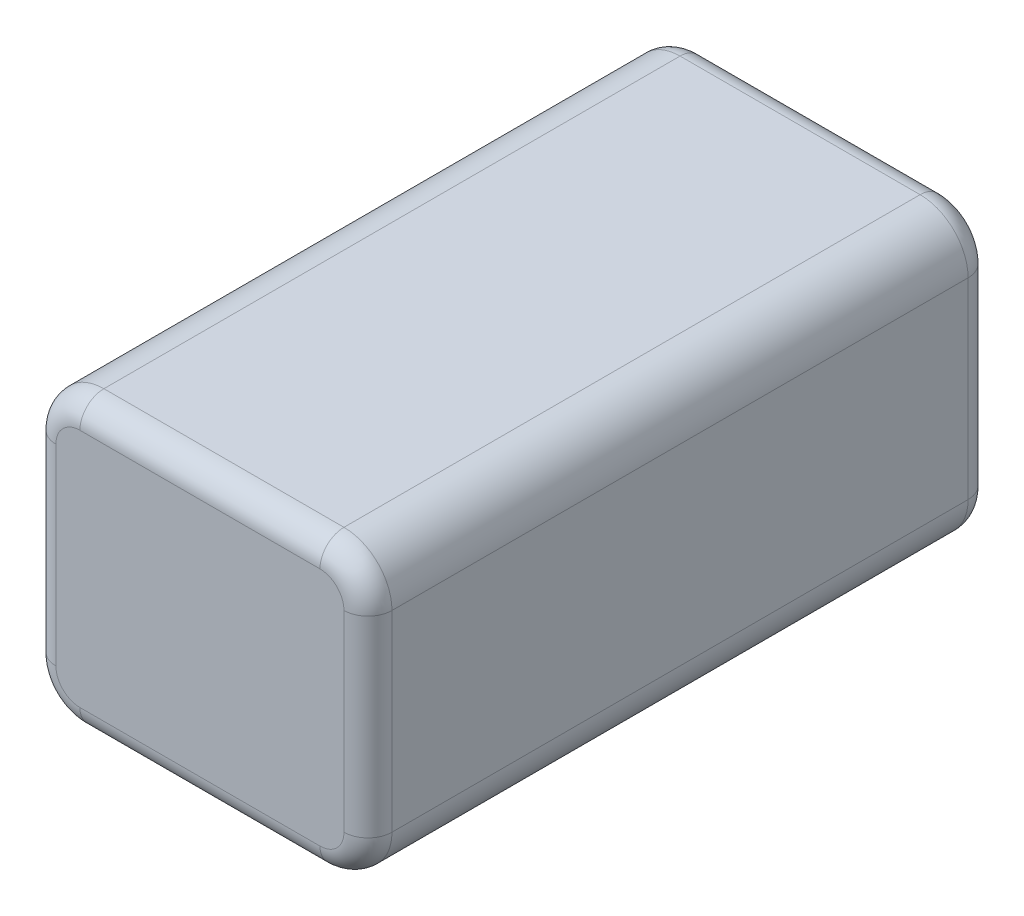
ISO-10303-21;
HEADER;
FILE_DESCRIPTION(('STEP AP214'),'2;1');
FILE_NAME('part.step','',(''),(''),'','','');
FILE_SCHEMA(('AUTOMOTIVE_DESIGN { 1 0 10303 214 1 1 1 1 }'));
ENDSEC;
DATA;
#1=APPLICATION_CONTEXT('core data for automotive mechanical design processes');
#2=APPLICATION_PROTOCOL_DEFINITION('international standard','automotive_design',2000,#1);
#3=PRODUCT_CONTEXT('',#1,'mechanical');
#4=PRODUCT('Part','Part','',(#3));
#5=PRODUCT_RELATED_PRODUCT_CATEGORY('part','',(#4));
#6=PRODUCT_DEFINITION_FORMATION('','',#4);
#7=PRODUCT_DEFINITION_CONTEXT('part definition',#1,'design');
#8=PRODUCT_DEFINITION('design','',#6,#7);
#9=PRODUCT_DEFINITION_SHAPE('','',#8);
#10=(LENGTH_UNIT() NAMED_UNIT(*) SI_UNIT(.MILLI.,.METRE.));
#11=(NAMED_UNIT(*) PLANE_ANGLE_UNIT() SI_UNIT($,.RADIAN.));
#12=(NAMED_UNIT(*) SI_UNIT($,.STERADIAN.) SOLID_ANGLE_UNIT());
#13=UNCERTAINTY_MEASURE_WITH_UNIT(LENGTH_MEASURE(1.E-05),#10,'distance_accuracy_value','');
#14=(GEOMETRIC_REPRESENTATION_CONTEXT(3) GLOBAL_UNCERTAINTY_ASSIGNED_CONTEXT((#13)) GLOBAL_UNIT_ASSIGNED_CONTEXT((#10,
#11,#12)) REPRESENTATION_CONTEXT('',''));
#15=CARTESIAN_POINT('',(0.,0.,0.));
#16=DIRECTION('',(0.,0.,1.));
#17=DIRECTION('',(1.,0.,0.));
#18=AXIS2_PLACEMENT_3D('',#15,#16,#17);
#19=CARTESIAN_POINT('',(12.7,10.16,33.02));
#20=DIRECTION('',(0.,0.,-1.));
#21=DIRECTION('',(-1.,0.,0.));
#22=AXIS2_PLACEMENT_3D('',#19,#20,#21);
#23=CYLINDRICAL_SURFACE('',#22,5.08);
#24=DIRECTION('',(0.,0.,-1.));
#25=VECTOR('',#24,1.);
#26=CARTESIAN_POINT('',(17.78,10.16,33.02));
#27=LINE('',#26,#25);
#28=CARTESIAN_POINT('',(17.78,10.16,30.48));
#29=VERTEX_POINT('',#28);
#30=CARTESIAN_POINT('',(17.78,10.16,-30.48));
#31=VERTEX_POINT('',#30);
#32=EDGE_CURVE('E263',#29,#31,#27,.T.);
#33=ORIENTED_EDGE('',*,*,#32,.T.);
#34=CARTESIAN_POINT('',(12.7,10.16,-30.48));
#35=DIRECTION('',(0.,0.,-1.));
#36=DIRECTION('',(-1.,0.,0.));
#37=AXIS2_PLACEMENT_3D('',#34,#35,#36);
#38=CIRCLE('',#37,5.08);
#39=CARTESIAN_POINT('',(12.7,15.24,-30.48));
#40=VERTEX_POINT('',#39);
#41=EDGE_CURVE('E228',#31,#40,#38,.F.);
#42=ORIENTED_EDGE('',*,*,#41,.T.);
#43=DIRECTION('',(0.,0.,-1.));
#44=VECTOR('',#43,1.);
#45=CARTESIAN_POINT('',(12.7,15.24,33.02));
#46=LINE('',#45,#44);
#47=CARTESIAN_POINT('',(12.7,15.24,30.48));
#48=VERTEX_POINT('',#47);
#49=EDGE_CURVE('E167',#48,#40,#46,.T.);
#50=ORIENTED_EDGE('',*,*,#49,.F.);
#51=CARTESIAN_POINT('',(12.7,10.16,30.48));
#52=DIRECTION('',(0.,0.,-1.));
#53=DIRECTION('',(-1.,0.,0.));
#54=AXIS2_PLACEMENT_3D('',#51,#52,#53);
#55=CIRCLE('',#54,5.08);
#56=EDGE_CURVE('E226',#48,#29,#55,.T.);
#57=ORIENTED_EDGE('',*,*,#56,.T.);
#58=EDGE_LOOP('',(#33,#42,#50,#57));
#59=FACE_BOUND('',#58,.T.);
#60=ADVANCED_FACE('F31',(#59),#23,.T.);
#61=CARTESIAN_POINT('',(-12.7,15.24,33.02));
#62=DIRECTION('',(0.,-1.,0.));
#63=DIRECTION('',(0.,0.,-1.));
#64=AXIS2_PLACEMENT_3D('',#61,#62,#63);
#65=PLANE('',#64);
#66=ORIENTED_EDGE('',*,*,#49,.T.);
#67=DIRECTION('',(-1.,0.,0.));
#68=VECTOR('',#67,1.);
#69=CARTESIAN_POINT('',(-12.7,15.24,-30.48));
#70=LINE('',#69,#68);
#71=CARTESIAN_POINT('',(-12.7,15.24,-30.48));
#72=VERTEX_POINT('',#71);
#73=EDGE_CURVE('E166',#40,#72,#70,.T.);
#74=ORIENTED_EDGE('',*,*,#73,.T.);
#75=DIRECTION('',(0.,0.,-1.));
#76=VECTOR('',#75,1.);
#77=CARTESIAN_POINT('',(-12.7,15.24,33.02));
#78=LINE('',#77,#76);
#79=CARTESIAN_POINT('',(-12.7,15.24,30.48));
#80=VERTEX_POINT('',#79);
#81=EDGE_CURVE('E148',#80,#72,#78,.T.);
#82=ORIENTED_EDGE('',*,*,#81,.F.);
#83=DIRECTION('',(-1.,0.,0.));
#84=VECTOR('',#83,1.);
#85=CARTESIAN_POINT('',(-12.7,15.24,30.48));
#86=LINE('',#85,#84);
#87=EDGE_CURVE('E163',#80,#48,#86,.F.);
#88=ORIENTED_EDGE('',*,*,#87,.T.);
#89=EDGE_LOOP('',(#66,#74,#82,#88));
#90=FACE_BOUND('',#89,.T.);
#91=ADVANCED_FACE('F161',(#90),#65,.F.);
#92=CARTESIAN_POINT('',(-12.7,10.16,33.02));
#93=DIRECTION('',(0.,0.,-1.));
#94=DIRECTION('',(-1.,0.,0.));
#95=AXIS2_PLACEMENT_3D('',#92,#93,#94);
#96=CYLINDRICAL_SURFACE('',#95,5.08);
#97=ORIENTED_EDGE('',*,*,#81,.T.);
#98=CARTESIAN_POINT('',(-12.7,10.16,-30.48));
#99=DIRECTION('',(0.,0.,-1.));
#100=DIRECTION('',(-1.,0.,0.));
#101=AXIS2_PLACEMENT_3D('',#98,#99,#100);
#102=CIRCLE('',#101,5.08);
#103=CARTESIAN_POINT('',(-17.78,10.16,-30.48));
#104=VERTEX_POINT('',#103);
#105=EDGE_CURVE('E155',#72,#104,#102,.F.);
#106=ORIENTED_EDGE('',*,*,#105,.T.);
#107=DIRECTION('',(0.,0.,-1.));
#108=VECTOR('',#107,1.);
#109=CARTESIAN_POINT('',(-17.78,10.16,33.02));
#110=LINE('',#109,#108);
#111=CARTESIAN_POINT('',(-17.78,10.16,30.48));
#112=VERTEX_POINT('',#111);
#113=EDGE_CURVE('E150',#112,#104,#110,.T.);
#114=ORIENTED_EDGE('',*,*,#113,.F.);
#115=CARTESIAN_POINT('',(-12.7,10.16,30.48));
#116=DIRECTION('',(0.,0.,-1.));
#117=DIRECTION('',(-1.,0.,0.));
#118=AXIS2_PLACEMENT_3D('',#115,#116,#117);
#119=CIRCLE('',#118,5.08);
#120=EDGE_CURVE('E145',#112,#80,#119,.T.);
#121=ORIENTED_EDGE('',*,*,#120,.T.);
#122=EDGE_LOOP('',(#97,#106,#114,#121));
#123=FACE_BOUND('',#122,.T.);
#124=ADVANCED_FACE('F147',(#123),#96,.T.);
#125=CARTESIAN_POINT('',(-17.78,-10.16,33.02));
#126=DIRECTION('',(1.,0.,0.));
#127=DIRECTION('',(0.,0.,-1.));
#128=AXIS2_PLACEMENT_3D('',#125,#126,#127);
#129=PLANE('',#128);
#130=ORIENTED_EDGE('',*,*,#113,.T.);
#131=DIRECTION('',(0.,-1.,0.));
#132=VECTOR('',#131,1.);
#133=CARTESIAN_POINT('',(-17.78,-10.16,-30.48));
#134=LINE('',#133,#132);
#135=CARTESIAN_POINT('',(-17.78,-10.16,-30.48));
#136=VERTEX_POINT('',#135);
#137=EDGE_CURVE('E207',#104,#136,#134,.T.);
#138=ORIENTED_EDGE('',*,*,#137,.T.);
#139=DIRECTION('',(0.,0.,-1.));
#140=VECTOR('',#139,1.);
#141=CARTESIAN_POINT('',(-17.78,-10.16,33.02));
#142=LINE('',#141,#140);
#143=CARTESIAN_POINT('',(-17.78,-10.16,30.48));
#144=VERTEX_POINT('',#143);
#145=EDGE_CURVE('E288',#144,#136,#142,.T.);
#146=ORIENTED_EDGE('',*,*,#145,.F.);
#147=DIRECTION('',(0.,-1.,0.));
#148=VECTOR('',#147,1.);
#149=CARTESIAN_POINT('',(-17.78,-10.16,30.48));
#150=LINE('',#149,#148);
#151=EDGE_CURVE('E205',#144,#112,#150,.F.);
#152=ORIENTED_EDGE('',*,*,#151,.T.);
#153=EDGE_LOOP('',(#130,#138,#146,#152));
#154=FACE_BOUND('',#153,.T.);
#155=ADVANCED_FACE('F285',(#154),#129,.F.);
#156=CARTESIAN_POINT('',(-12.7,-10.16,33.02));
#157=DIRECTION('',(0.,0.,-1.));
#158=DIRECTION('',(-1.,0.,0.));
#159=AXIS2_PLACEMENT_3D('',#156,#157,#158);
#160=CYLINDRICAL_SURFACE('',#159,5.08);
#161=ORIENTED_EDGE('',*,*,#145,.T.);
#162=CARTESIAN_POINT('',(-12.7,-10.16,-30.48));
#163=DIRECTION('',(0.,0.,-1.));
#164=DIRECTION('',(-1.,0.,0.));
#165=AXIS2_PLACEMENT_3D('',#162,#163,#164);
#166=CIRCLE('',#165,5.08);
#167=CARTESIAN_POINT('',(-12.7,-15.24,-30.48));
#168=VERTEX_POINT('',#167);
#169=EDGE_CURVE('E211',#136,#168,#166,.F.);
#170=ORIENTED_EDGE('',*,*,#169,.T.);
#171=DIRECTION('',(0.,0.,-1.));
#172=VECTOR('',#171,1.);
#173=CARTESIAN_POINT('',(-12.7,-15.24,33.02));
#174=LINE('',#173,#172);
#175=CARTESIAN_POINT('',(-12.7,-15.24,30.48));
#176=VERTEX_POINT('',#175);
#177=EDGE_CURVE('E291',#176,#168,#174,.T.);
#178=ORIENTED_EDGE('',*,*,#177,.F.);
#179=CARTESIAN_POINT('',(-12.7,-10.16,30.48));
#180=DIRECTION('',(0.,0.,-1.));
#181=DIRECTION('',(-1.,0.,0.));
#182=AXIS2_PLACEMENT_3D('',#179,#180,#181);
#183=CIRCLE('',#182,5.08);
#184=EDGE_CURVE('E209',#176,#144,#183,.T.);
#185=ORIENTED_EDGE('',*,*,#184,.T.);
#186=EDGE_LOOP('',(#161,#170,#178,#185));
#187=FACE_BOUND('',#186,.T.);
#188=ADVANCED_FACE('F336',(#187),#160,.T.);
#189=CARTESIAN_POINT('',(-12.7,-15.24,33.02));
#190=DIRECTION('',(0.,1.,0.));
#191=DIRECTION('',(0.,0.,1.));
#192=AXIS2_PLACEMENT_3D('',#189,#190,#191);
#193=PLANE('',#192);
#194=ORIENTED_EDGE('',*,*,#177,.T.);
#195=DIRECTION('',(1.,0.,0.));
#196=VECTOR('',#195,1.);
#197=CARTESIAN_POINT('',(12.7,-15.24,-30.48));
#198=LINE('',#197,#196);
#199=CARTESIAN_POINT('',(12.7,-15.24,-30.48));
#200=VERTEX_POINT('',#199);
#201=EDGE_CURVE('E215',#168,#200,#198,.T.);
#202=ORIENTED_EDGE('',*,*,#201,.T.);
#203=DIRECTION('',(0.,0.,-1.));
#204=VECTOR('',#203,1.);
#205=CARTESIAN_POINT('',(12.7,-15.24,33.02));
#206=LINE('',#205,#204);
#207=CARTESIAN_POINT('',(12.7,-15.24,30.48));
#208=VERTEX_POINT('',#207);
#209=EDGE_CURVE('E295',#208,#200,#206,.T.);
#210=ORIENTED_EDGE('',*,*,#209,.F.);
#211=DIRECTION('',(1.,0.,0.));
#212=VECTOR('',#211,1.);
#213=CARTESIAN_POINT('',(-12.7,-15.24,30.48));
#214=LINE('',#213,#212);
#215=EDGE_CURVE('E213',#208,#176,#214,.F.);
#216=ORIENTED_EDGE('',*,*,#215,.T.);
#217=EDGE_LOOP('',(#194,#202,#210,#216));
#218=FACE_BOUND('',#217,.T.);
#219=ADVANCED_FACE('F339',(#218),#193,.F.);
#220=CARTESIAN_POINT('',(12.7,-10.16,33.02));
#221=DIRECTION('',(0.,0.,-1.));
#222=DIRECTION('',(-1.,0.,0.));
#223=AXIS2_PLACEMENT_3D('',#220,#221,#222);
#224=CYLINDRICAL_SURFACE('',#223,5.08);
#225=ORIENTED_EDGE('',*,*,#209,.T.);
#226=CARTESIAN_POINT('',(12.7,-10.16,-30.48));
#227=DIRECTION('',(0.,0.,-1.));
#228=DIRECTION('',(-1.,0.,0.));
#229=AXIS2_PLACEMENT_3D('',#226,#227,#228);
#230=CIRCLE('',#229,5.08);
#231=CARTESIAN_POINT('',(17.78,-10.16,-30.48));
#232=VERTEX_POINT('',#231);
#233=EDGE_CURVE('E219',#200,#232,#230,.F.);
#234=ORIENTED_EDGE('',*,*,#233,.T.);
#235=DIRECTION('',(0.,0.,-1.));
#236=VECTOR('',#235,1.);
#237=CARTESIAN_POINT('',(17.78,-10.16,33.02));
#238=LINE('',#237,#236);
#239=CARTESIAN_POINT('',(17.78,-10.16,30.48));
#240=VERTEX_POINT('',#239);
#241=EDGE_CURVE('E300',#240,#232,#238,.T.);
#242=ORIENTED_EDGE('',*,*,#241,.F.);
#243=CARTESIAN_POINT('',(12.7,-10.16,30.48));
#244=DIRECTION('',(0.,0.,-1.));
#245=DIRECTION('',(-1.,0.,0.));
#246=AXIS2_PLACEMENT_3D('',#243,#244,#245);
#247=CIRCLE('',#246,5.08);
#248=EDGE_CURVE('E217',#240,#208,#247,.T.);
#249=ORIENTED_EDGE('',*,*,#248,.T.);
#250=EDGE_LOOP('',(#225,#234,#242,#249));
#251=FACE_BOUND('',#250,.T.);
#252=ADVANCED_FACE('F353',(#251),#224,.T.);
#253=CARTESIAN_POINT('',(17.78,-10.16,33.02));
#254=DIRECTION('',(-1.,0.,0.));
#255=DIRECTION('',(0.,0.,1.));
#256=AXIS2_PLACEMENT_3D('',#253,#254,#255);
#257=PLANE('',#256);
#258=ORIENTED_EDGE('',*,*,#241,.T.);
#259=DIRECTION('',(0.,1.,0.));
#260=VECTOR('',#259,1.);
#261=CARTESIAN_POINT('',(17.78,10.16,-30.48));
#262=LINE('',#261,#260);
#263=EDGE_CURVE('E224',#232,#31,#262,.T.);
#264=ORIENTED_EDGE('',*,*,#263,.T.);
#265=ORIENTED_EDGE('',*,*,#32,.F.);
#266=DIRECTION('',(0.,1.,0.));
#267=VECTOR('',#266,1.);
#268=CARTESIAN_POINT('',(17.78,-10.16,30.48));
#269=LINE('',#268,#267);
#270=EDGE_CURVE('E221',#29,#240,#269,.F.);
#271=ORIENTED_EDGE('',*,*,#270,.T.);
#272=EDGE_LOOP('',(#258,#264,#265,#271));
#273=FACE_BOUND('',#272,.T.);
#274=ADVANCED_FACE('F354',(#273),#257,.F.);
#275=CARTESIAN_POINT('',(12.7,10.16,33.02));
#276=DIRECTION('',(0.,0.,-1.));
#277=DIRECTION('',(-1.,0.,0.));
#278=AXIS2_PLACEMENT_3D('',#275,#276,#277);
#279=PLANE('',#278);
#280=CARTESIAN_POINT('',(12.7,-10.16,33.02));
#281=DIRECTION('',(0.,0.,-1.));
#282=DIRECTION('',(-1.,0.,0.));
#283=AXIS2_PLACEMENT_3D('',#280,#281,#282);
#284=CIRCLE('',#283,2.54);
#285=CARTESIAN_POINT('',(12.7,-12.7,33.02));
#286=VERTEX_POINT('',#285);
#287=CARTESIAN_POINT('',(15.24,-10.16,33.02));
#288=VERTEX_POINT('',#287);
#289=EDGE_CURVE('E40',#286,#288,#284,.F.);
#290=ORIENTED_EDGE('',*,*,#289,.T.);
#291=DIRECTION('',(0.,1.,0.));
#292=VECTOR('',#291,1.);
#293=CARTESIAN_POINT('',(15.24,10.16,33.02));
#294=LINE('',#293,#292);
#295=CARTESIAN_POINT('',(15.24,10.16,33.02));
#296=VERTEX_POINT('',#295);
#297=EDGE_CURVE('E11',#288,#296,#294,.T.);
#298=ORIENTED_EDGE('',*,*,#297,.T.);
#299=CARTESIAN_POINT('',(12.7,10.16,33.02));
#300=DIRECTION('',(0.,0.,-1.));
#301=DIRECTION('',(-1.,0.,0.));
#302=AXIS2_PLACEMENT_3D('',#299,#300,#301);
#303=CIRCLE('',#302,2.54);
#304=CARTESIAN_POINT('',(12.7,12.7,33.02));
#305=VERTEX_POINT('',#304);
#306=EDGE_CURVE('E230',#296,#305,#303,.F.);
#307=ORIENTED_EDGE('',*,*,#306,.T.);
#308=DIRECTION('',(-1.,0.,0.));
#309=VECTOR('',#308,1.);
#310=CARTESIAN_POINT('',(12.7,12.7,33.02));
#311=LINE('',#310,#309);
#312=CARTESIAN_POINT('',(-12.7,12.7,33.02));
#313=VERTEX_POINT('',#312);
#314=EDGE_CURVE('E232',#305,#313,#311,.T.);
#315=ORIENTED_EDGE('',*,*,#314,.T.);
#316=CARTESIAN_POINT('',(-12.7,10.16,33.02));
#317=DIRECTION('',(0.,0.,-1.));
#318=DIRECTION('',(-1.,0.,0.));
#319=AXIS2_PLACEMENT_3D('',#316,#317,#318);
#320=CIRCLE('',#319,2.54);
#321=CARTESIAN_POINT('',(-15.24,10.16,33.02));
#322=VERTEX_POINT('',#321);
#323=EDGE_CURVE('E173',#313,#322,#320,.F.);
#324=ORIENTED_EDGE('',*,*,#323,.T.);
#325=DIRECTION('',(0.,-1.,0.));
#326=VECTOR('',#325,1.);
#327=CARTESIAN_POINT('',(-15.24,10.16,33.02));
#328=LINE('',#327,#326);
#329=CARTESIAN_POINT('',(-15.24,-10.16,33.02));
#330=VERTEX_POINT('',#329);
#331=EDGE_CURVE('E235',#322,#330,#328,.T.);
#332=ORIENTED_EDGE('',*,*,#331,.T.);
#333=CARTESIAN_POINT('',(-12.7,-10.16,33.02));
#334=DIRECTION('',(0.,0.,-1.));
#335=DIRECTION('',(-1.,0.,0.));
#336=AXIS2_PLACEMENT_3D('',#333,#334,#335);
#337=CIRCLE('',#336,2.54);
#338=CARTESIAN_POINT('',(-12.7,-12.7,33.02));
#339=VERTEX_POINT('',#338);
#340=EDGE_CURVE('E237',#330,#339,#337,.F.);
#341=ORIENTED_EDGE('',*,*,#340,.T.);
#342=DIRECTION('',(1.,0.,0.));
#343=VECTOR('',#342,1.);
#344=CARTESIAN_POINT('',(12.7,-12.7,33.02));
#345=LINE('',#344,#343);
#346=EDGE_CURVE('E51',#339,#286,#345,.T.);
#347=ORIENTED_EDGE('',*,*,#346,.T.);
#348=EDGE_LOOP('',(#290,#298,#307,#315,#324,#332,#341,#347));
#349=FACE_BOUND('',#348,.T.);
#350=ADVANCED_FACE('F363',(#349),#279,.F.);
#351=CARTESIAN_POINT('',(12.7,10.16,-33.02));
#352=DIRECTION('',(0.,0.,-1.));
#353=DIRECTION('',(-1.,0.,0.));
#354=AXIS2_PLACEMENT_3D('',#351,#352,#353);
#355=PLANE('',#354);
#356=CARTESIAN_POINT('',(-12.7,10.16,-33.02));
#357=DIRECTION('',(0.,0.,-1.));
#358=DIRECTION('',(-1.,0.,0.));
#359=AXIS2_PLACEMENT_3D('',#356,#357,#358);
#360=CIRCLE('',#359,2.54);
#361=CARTESIAN_POINT('',(-15.24,10.16,-33.02));
#362=VERTEX_POINT('',#361);
#363=CARTESIAN_POINT('',(-12.7,12.7,-33.02));
#364=VERTEX_POINT('',#363);
#365=EDGE_CURVE('E200',#362,#364,#360,.T.);
#366=ORIENTED_EDGE('',*,*,#365,.T.);
#367=DIRECTION('',(-1.,0.,0.));
#368=VECTOR('',#367,1.);
#369=CARTESIAN_POINT('',(12.7,12.7,-33.02));
#370=LINE('',#369,#368);
#371=CARTESIAN_POINT('',(12.7,12.7,-33.02));
#372=VERTEX_POINT('',#371);
#373=EDGE_CURVE('E156',#364,#372,#370,.F.);
#374=ORIENTED_EDGE('',*,*,#373,.T.);
#375=CARTESIAN_POINT('',(12.7,10.16,-33.02));
#376=DIRECTION('',(0.,0.,-1.));
#377=DIRECTION('',(-1.,0.,0.));
#378=AXIS2_PLACEMENT_3D('',#375,#376,#377);
#379=CIRCLE('',#378,2.54);
#380=CARTESIAN_POINT('',(15.24,10.16,-33.02));
#381=VERTEX_POINT('',#380);
#382=EDGE_CURVE('E185',#372,#381,#379,.T.);
#383=ORIENTED_EDGE('',*,*,#382,.T.);
#384=DIRECTION('',(0.,1.,0.));
#385=VECTOR('',#384,1.);
#386=CARTESIAN_POINT('',(15.24,-10.16,-33.02));
#387=LINE('',#386,#385);
#388=CARTESIAN_POINT('',(15.24,-10.16,-33.02));
#389=VERTEX_POINT('',#388);
#390=EDGE_CURVE('E190',#381,#389,#387,.F.);
#391=ORIENTED_EDGE('',*,*,#390,.T.);
#392=CARTESIAN_POINT('',(12.7,-10.16,-33.02));
#393=DIRECTION('',(0.,0.,-1.));
#394=DIRECTION('',(-1.,0.,0.));
#395=AXIS2_PLACEMENT_3D('',#392,#393,#394);
#396=CIRCLE('',#395,2.54);
#397=CARTESIAN_POINT('',(12.7,-12.7,-33.02));
#398=VERTEX_POINT('',#397);
#399=EDGE_CURVE('E192',#389,#398,#396,.T.);
#400=ORIENTED_EDGE('',*,*,#399,.T.);
#401=DIRECTION('',(1.,0.,0.));
#402=VECTOR('',#401,1.);
#403=CARTESIAN_POINT('',(-12.7,-12.7,-33.02));
#404=LINE('',#403,#402);
#405=CARTESIAN_POINT('',(-12.7,-12.7,-33.02));
#406=VERTEX_POINT('',#405);
#407=EDGE_CURVE('E194',#398,#406,#404,.F.);
#408=ORIENTED_EDGE('',*,*,#407,.T.);
#409=CARTESIAN_POINT('',(-12.7,-10.16,-33.02));
#410=DIRECTION('',(0.,0.,-1.));
#411=DIRECTION('',(-1.,0.,0.));
#412=AXIS2_PLACEMENT_3D('',#409,#410,#411);
#413=CIRCLE('',#412,2.54);
#414=CARTESIAN_POINT('',(-15.24,-10.16,-33.02));
#415=VERTEX_POINT('',#414);
#416=EDGE_CURVE('E196',#406,#415,#413,.T.);
#417=ORIENTED_EDGE('',*,*,#416,.T.);
#418=DIRECTION('',(0.,-1.,0.));
#419=VECTOR('',#418,1.);
#420=CARTESIAN_POINT('',(-15.24,10.16,-33.02));
#421=LINE('',#420,#419);
#422=EDGE_CURVE('E198',#415,#362,#421,.F.);
#423=ORIENTED_EDGE('',*,*,#422,.T.);
#424=EDGE_LOOP('',(#366,#374,#383,#391,#400,#408,#417,#423));
#425=FACE_BOUND('',#424,.T.);
#426=ADVANCED_FACE('F365',(#425),#355,.T.);
#427=CARTESIAN_POINT('',(-12.7,-12.7,-30.48));
#428=DIRECTION('',(-1.,0.,0.));
#429=DIRECTION('',(0.,0.,1.));
#430=AXIS2_PLACEMENT_3D('',#427,#428,#429);
#431=CYLINDRICAL_SURFACE('',#430,2.54);
#432=CARTESIAN_POINT('',(-12.7,-12.7,-30.48));
#433=DIRECTION('',(-1.,0.,0.));
#434=DIRECTION('',(0.,-1.,0.));
#435=AXIS2_PLACEMENT_3D('',#432,#433,#434);
#436=CIRCLE('',#435,2.54);
#437=EDGE_CURVE('E257',#406,#168,#436,.T.);
#438=ORIENTED_EDGE('',*,*,#437,.F.);
#439=ORIENTED_EDGE('',*,*,#407,.F.);
#440=CARTESIAN_POINT('',(12.7,-12.7,-30.48));
#441=DIRECTION('',(1.,0.,0.));
#442=DIRECTION('',(0.,0.,-1.));
#443=AXIS2_PLACEMENT_3D('',#440,#441,#442);
#444=CIRCLE('',#443,2.54);
#445=EDGE_CURVE('E260',#200,#398,#444,.T.);
#446=ORIENTED_EDGE('',*,*,#445,.F.);
#447=ORIENTED_EDGE('',*,*,#201,.F.);
#448=EDGE_LOOP('',(#438,#439,#446,#447));
#449=FACE_BOUND('',#448,.T.);
#450=ADVANCED_FACE('F344',(#449),#431,.T.);
#451=CARTESIAN_POINT('',(12.7,-10.16,-30.48));
#452=DIRECTION('',(0.,0.,-1.));
#453=DIRECTION('',(-1.,0.,0.));
#454=AXIS2_PLACEMENT_3D('',#451,#452,#453);
#455=DEGENERATE_TOROIDAL_SURFACE('',#454,2.54,2.54,.T.);
#456=ORIENTED_EDGE('',*,*,#445,.T.);
#457=ORIENTED_EDGE('',*,*,#399,.F.);
#458=CARTESIAN_POINT('',(15.24,-10.16,-30.48));
#459=DIRECTION('',(0.,1.,0.));
#460=DIRECTION('',(-1.,0.,0.));
#461=AXIS2_PLACEMENT_3D('',#458,#459,#460);
#462=CIRCLE('',#461,2.54);
#463=EDGE_CURVE('E254',#232,#389,#462,.T.);
#464=ORIENTED_EDGE('',*,*,#463,.F.);
#465=ORIENTED_EDGE('',*,*,#233,.F.);
#466=EDGE_LOOP('',(#456,#457,#464,#465));
#467=FACE_BOUND('',#466,.T.);
#468=ADVANCED_FACE('F350',(#467),#455,.T.);
#469=CARTESIAN_POINT('',(-12.7,-10.16,-30.48));
#470=DIRECTION('',(0.,0.,-1.));
#471=DIRECTION('',(-1.,0.,0.));
#472=AXIS2_PLACEMENT_3D('',#469,#470,#471);
#473=DEGENERATE_TOROIDAL_SURFACE('',#472,2.54,2.54,.T.);
#474=ORIENTED_EDGE('',*,*,#437,.T.);
#475=ORIENTED_EDGE('',*,*,#169,.F.);
#476=CARTESIAN_POINT('',(-15.24,-10.16,-30.48));
#477=DIRECTION('',(0.,1.,0.));
#478=DIRECTION('',(0.,0.,1.));
#479=AXIS2_PLACEMENT_3D('',#476,#477,#478);
#480=CIRCLE('',#479,2.54);
#481=EDGE_CURVE('E251',#415,#136,#480,.T.);
#482=ORIENTED_EDGE('',*,*,#481,.F.);
#483=ORIENTED_EDGE('',*,*,#416,.F.);
#484=EDGE_LOOP('',(#474,#475,#482,#483));
#485=FACE_BOUND('',#484,.T.);
#486=ADVANCED_FACE('F333',(#485),#473,.T.);
#487=CARTESIAN_POINT('',(15.24,-10.16,-30.48));
#488=DIRECTION('',(0.,-1.,0.));
#489=DIRECTION('',(0.,0.,-1.));
#490=AXIS2_PLACEMENT_3D('',#487,#488,#489);
#491=CYLINDRICAL_SURFACE('',#490,2.54);
#492=ORIENTED_EDGE('',*,*,#463,.T.);
#493=ORIENTED_EDGE('',*,*,#390,.F.);
#494=CARTESIAN_POINT('',(15.24,10.16,-30.48));
#495=DIRECTION('',(0.,1.,0.));
#496=DIRECTION('',(0.,0.,1.));
#497=AXIS2_PLACEMENT_3D('',#494,#495,#496);
#498=CIRCLE('',#497,2.54);
#499=EDGE_CURVE('E248',#31,#381,#498,.T.);
#500=ORIENTED_EDGE('',*,*,#499,.F.);
#501=ORIENTED_EDGE('',*,*,#263,.F.);
#502=EDGE_LOOP('',(#492,#493,#500,#501));
#503=FACE_BOUND('',#502,.T.);
#504=ADVANCED_FACE('F313',(#503),#491,.T.);
#505=CARTESIAN_POINT('',(-15.24,-10.16,-30.48));
#506=DIRECTION('',(0.,1.,0.));
#507=DIRECTION('',(0.,0.,1.));
#508=AXIS2_PLACEMENT_3D('',#505,#506,#507);
#509=CYLINDRICAL_SURFACE('',#508,2.54);
#510=ORIENTED_EDGE('',*,*,#481,.T.);
#511=ORIENTED_EDGE('',*,*,#137,.F.);
#512=CARTESIAN_POINT('',(-15.24,10.16,-30.48));
#513=DIRECTION('',(0.,1.,0.));
#514=DIRECTION('',(-1.,0.,0.));
#515=AXIS2_PLACEMENT_3D('',#512,#513,#514);
#516=CIRCLE('',#515,2.54);
#517=EDGE_CURVE('E245',#362,#104,#516,.T.);
#518=ORIENTED_EDGE('',*,*,#517,.F.);
#519=ORIENTED_EDGE('',*,*,#422,.F.);
#520=EDGE_LOOP('',(#510,#511,#518,#519));
#521=FACE_BOUND('',#520,.T.);
#522=ADVANCED_FACE('F329',(#521),#509,.T.);
#523=CARTESIAN_POINT('',(12.7,10.16,-30.48));
#524=DIRECTION('',(0.,0.,-1.));
#525=DIRECTION('',(-1.,0.,0.));
#526=AXIS2_PLACEMENT_3D('',#523,#524,#525);
#527=DEGENERATE_TOROIDAL_SURFACE('',#526,2.54,2.54,.T.);
#528=ORIENTED_EDGE('',*,*,#499,.T.);
#529=ORIENTED_EDGE('',*,*,#382,.F.);
#530=CARTESIAN_POINT('',(12.7,12.7,-30.48));
#531=DIRECTION('',(-1.,0.,0.));
#532=DIRECTION('',(0.,-1.,0.));
#533=AXIS2_PLACEMENT_3D('',#530,#531,#532);
#534=CIRCLE('',#533,2.54);
#535=EDGE_CURVE('E243',#40,#372,#534,.T.);
#536=ORIENTED_EDGE('',*,*,#535,.F.);
#537=ORIENTED_EDGE('',*,*,#41,.F.);
#538=EDGE_LOOP('',(#528,#529,#536,#537));
#539=FACE_BOUND('',#538,.T.);
#540=ADVANCED_FACE('F317',(#539),#527,.T.);
#541=CARTESIAN_POINT('',(-12.7,10.16,-30.48));
#542=DIRECTION('',(0.,0.,-1.));
#543=DIRECTION('',(-1.,0.,0.));
#544=AXIS2_PLACEMENT_3D('',#541,#542,#543);
#545=DEGENERATE_TOROIDAL_SURFACE('',#544,2.54,2.54,.T.);
#546=ORIENTED_EDGE('',*,*,#517,.T.);
#547=ORIENTED_EDGE('',*,*,#105,.F.);
#548=CARTESIAN_POINT('',(-12.7,12.7,-30.48));
#549=DIRECTION('',(1.,0.,0.));
#550=DIRECTION('',(0.,0.,-1.));
#551=AXIS2_PLACEMENT_3D('',#548,#549,#550);
#552=CIRCLE('',#551,2.54);
#553=EDGE_CURVE('E241',#364,#72,#552,.T.);
#554=ORIENTED_EDGE('',*,*,#553,.F.);
#555=ORIENTED_EDGE('',*,*,#365,.F.);
#556=EDGE_LOOP('',(#546,#547,#554,#555));
#557=FACE_BOUND('',#556,.T.);
#558=ADVANCED_FACE('F325',(#557),#545,.T.);
#559=CARTESIAN_POINT('',(-12.7,12.7,-30.48));
#560=DIRECTION('',(1.,0.,0.));
#561=DIRECTION('',(0.,0.,-1.));
#562=AXIS2_PLACEMENT_3D('',#559,#560,#561);
#563=CYLINDRICAL_SURFACE('',#562,2.54);
#564=ORIENTED_EDGE('',*,*,#535,.T.);
#565=ORIENTED_EDGE('',*,*,#373,.F.);
#566=ORIENTED_EDGE('',*,*,#553,.T.);
#567=ORIENTED_EDGE('',*,*,#73,.F.);
#568=EDGE_LOOP('',(#564,#565,#566,#567));
#569=FACE_BOUND('',#568,.T.);
#570=ADVANCED_FACE('F320',(#569),#563,.T.);
#571=CARTESIAN_POINT('',(-15.24,10.16,30.48));
#572=DIRECTION('',(0.,-1.,0.));
#573=DIRECTION('',(0.,0.,-1.));
#574=AXIS2_PLACEMENT_3D('',#571,#572,#573);
#575=CYLINDRICAL_SURFACE('',#574,2.54);
#576=CARTESIAN_POINT('',(-15.24,10.16,30.48));
#577=DIRECTION('',(0.,1.,0.));
#578=DIRECTION('',(0.,0.,1.));
#579=AXIS2_PLACEMENT_3D('',#576,#577,#578);
#580=CIRCLE('',#579,2.54);
#581=EDGE_CURVE('E272',#112,#322,#580,.T.);
#582=ORIENTED_EDGE('',*,*,#581,.F.);
#583=ORIENTED_EDGE('',*,*,#151,.F.);
#584=CARTESIAN_POINT('',(-15.24,-10.16,30.48));
#585=DIRECTION('',(0.,-1.,0.));
#586=DIRECTION('',(1.,0.,0.));
#587=AXIS2_PLACEMENT_3D('',#584,#585,#586);
#588=CIRCLE('',#587,2.54);
#589=EDGE_CURVE('E35',#330,#144,#588,.T.);
#590=ORIENTED_EDGE('',*,*,#589,.F.);
#591=ORIENTED_EDGE('',*,*,#331,.F.);
#592=EDGE_LOOP('',(#582,#583,#590,#591));
#593=FACE_BOUND('',#592,.T.);
#594=ADVANCED_FACE('F33',(#593),#575,.T.);
#595=CARTESIAN_POINT('',(-12.7,-10.16,30.48));
#596=DIRECTION('',(0.,0.,-1.));
#597=DIRECTION('',(-1.,0.,0.));
#598=AXIS2_PLACEMENT_3D('',#595,#596,#597);
#599=DEGENERATE_TOROIDAL_SURFACE('',#598,2.54,2.54,.T.);
#600=ORIENTED_EDGE('',*,*,#589,.T.);
#601=ORIENTED_EDGE('',*,*,#184,.F.);
#602=CARTESIAN_POINT('',(-12.7,-12.7,30.48));
#603=DIRECTION('',(1.,0.,0.));
#604=DIRECTION('',(0.,0.,-1.));
#605=AXIS2_PLACEMENT_3D('',#602,#603,#604);
#606=CIRCLE('',#605,2.54);
#607=EDGE_CURVE('E176',#339,#176,#606,.T.);
#608=ORIENTED_EDGE('',*,*,#607,.F.);
#609=ORIENTED_EDGE('',*,*,#340,.F.);
#610=EDGE_LOOP('',(#600,#601,#608,#609));
#611=FACE_BOUND('',#610,.T.);
#612=ADVANCED_FACE('F278',(#611),#599,.T.);
#613=CARTESIAN_POINT('',(-12.7,10.16,30.48));
#614=DIRECTION('',(0.,0.,-1.));
#615=DIRECTION('',(-1.,0.,0.));
#616=AXIS2_PLACEMENT_3D('',#613,#614,#615);
#617=DEGENERATE_TOROIDAL_SURFACE('',#616,2.54,2.54,.T.);
#618=ORIENTED_EDGE('',*,*,#581,.T.);
#619=ORIENTED_EDGE('',*,*,#323,.F.);
#620=CARTESIAN_POINT('',(-12.7,12.7,30.48));
#621=DIRECTION('',(1.,0.,0.));
#622=DIRECTION('',(0.,1.,0.));
#623=AXIS2_PLACEMENT_3D('',#620,#621,#622);
#624=CIRCLE('',#623,2.54);
#625=EDGE_CURVE('E171',#80,#313,#624,.T.);
#626=ORIENTED_EDGE('',*,*,#625,.F.);
#627=ORIENTED_EDGE('',*,*,#120,.F.);
#628=EDGE_LOOP('',(#618,#619,#626,#627));
#629=FACE_BOUND('',#628,.T.);
#630=ADVANCED_FACE('F172',(#629),#617,.T.);
#631=CARTESIAN_POINT('',(12.7,-12.7,30.48));
#632=DIRECTION('',(1.,0.,0.));
#633=DIRECTION('',(0.,0.,-1.));
#634=AXIS2_PLACEMENT_3D('',#631,#632,#633);
#635=CYLINDRICAL_SURFACE('',#634,2.54);
#636=ORIENTED_EDGE('',*,*,#607,.T.);
#637=ORIENTED_EDGE('',*,*,#215,.F.);
#638=CARTESIAN_POINT('',(12.7,-12.7,30.48));
#639=DIRECTION('',(1.,0.,0.));
#640=DIRECTION('',(0.,1.,0.));
#641=AXIS2_PLACEMENT_3D('',#638,#639,#640);
#642=CIRCLE('',#641,2.54);
#643=EDGE_CURVE('E177',#286,#208,#642,.T.);
#644=ORIENTED_EDGE('',*,*,#643,.F.);
#645=ORIENTED_EDGE('',*,*,#346,.F.);
#646=EDGE_LOOP('',(#636,#637,#644,#645));
#647=FACE_BOUND('',#646,.T.);
#648=ADVANCED_FACE('F408',(#647),#635,.T.);
#649=CARTESIAN_POINT('',(12.7,12.7,30.48));
#650=DIRECTION('',(-1.,0.,0.));
#651=DIRECTION('',(0.,0.,1.));
#652=AXIS2_PLACEMENT_3D('',#649,#650,#651);
#653=CYLINDRICAL_SURFACE('',#652,2.54);
#654=ORIENTED_EDGE('',*,*,#625,.T.);
#655=ORIENTED_EDGE('',*,*,#314,.F.);
#656=CARTESIAN_POINT('',(12.7,12.7,30.48));
#657=DIRECTION('',(1.,0.,0.));
#658=DIRECTION('',(0.,0.,-1.));
#659=AXIS2_PLACEMENT_3D('',#656,#657,#658);
#660=CIRCLE('',#659,2.54);
#661=EDGE_CURVE('E182',#48,#305,#660,.T.);
#662=ORIENTED_EDGE('',*,*,#661,.F.);
#663=ORIENTED_EDGE('',*,*,#87,.F.);
#664=EDGE_LOOP('',(#654,#655,#662,#663));
#665=FACE_BOUND('',#664,.T.);
#666=ADVANCED_FACE('F180',(#665),#653,.T.);
#667=CARTESIAN_POINT('',(12.7,-10.16,30.48));
#668=DIRECTION('',(0.,0.,-1.));
#669=DIRECTION('',(-1.,0.,0.));
#670=AXIS2_PLACEMENT_3D('',#667,#668,#669);
#671=DEGENERATE_TOROIDAL_SURFACE('',#670,2.54,2.54,.T.);
#672=ORIENTED_EDGE('',*,*,#643,.T.);
#673=ORIENTED_EDGE('',*,*,#248,.F.);
#674=CARTESIAN_POINT('',(15.24,-10.16,30.48));
#675=DIRECTION('',(0.,1.,0.));
#676=DIRECTION('',(0.,0.,1.));
#677=AXIS2_PLACEMENT_3D('',#674,#675,#676);
#678=CIRCLE('',#677,2.54);
#679=EDGE_CURVE('E266',#288,#240,#678,.T.);
#680=ORIENTED_EDGE('',*,*,#679,.F.);
#681=ORIENTED_EDGE('',*,*,#289,.F.);
#682=EDGE_LOOP('',(#672,#673,#680,#681));
#683=FACE_BOUND('',#682,.T.);
#684=ADVANCED_FACE('F402',(#683),#671,.T.);
#685=CARTESIAN_POINT('',(12.7,10.16,30.48));
#686=DIRECTION('',(0.,0.,-1.));
#687=DIRECTION('',(-1.,0.,0.));
#688=AXIS2_PLACEMENT_3D('',#685,#686,#687);
#689=DEGENERATE_TOROIDAL_SURFACE('',#688,2.54,2.54,.T.);
#690=ORIENTED_EDGE('',*,*,#661,.T.);
#691=ORIENTED_EDGE('',*,*,#306,.F.);
#692=CARTESIAN_POINT('',(15.24,10.16,30.48));
#693=DIRECTION('',(0.,-1.,0.));
#694=DIRECTION('',(0.,0.,-1.));
#695=AXIS2_PLACEMENT_3D('',#692,#693,#694);
#696=CIRCLE('',#695,2.54);
#697=EDGE_CURVE('E264',#29,#296,#696,.T.);
#698=ORIENTED_EDGE('',*,*,#697,.F.);
#699=ORIENTED_EDGE('',*,*,#56,.F.);
#700=EDGE_LOOP('',(#690,#691,#698,#699));
#701=FACE_BOUND('',#700,.T.);
#702=ADVANCED_FACE('F362',(#701),#689,.T.);
#703=CARTESIAN_POINT('',(15.24,10.16,30.48));
#704=DIRECTION('',(0.,1.,0.));
#705=DIRECTION('',(0.,0.,1.));
#706=AXIS2_PLACEMENT_3D('',#703,#704,#705);
#707=CYLINDRICAL_SURFACE('',#706,2.54);
#708=ORIENTED_EDGE('',*,*,#679,.T.);
#709=ORIENTED_EDGE('',*,*,#270,.F.);
#710=ORIENTED_EDGE('',*,*,#697,.T.);
#711=ORIENTED_EDGE('',*,*,#297,.F.);
#712=EDGE_LOOP('',(#708,#709,#710,#711));
#713=FACE_BOUND('',#712,.T.);
#714=ADVANCED_FACE('F357',(#713),#707,.T.);
#715=CLOSED_SHELL('',(#60,#91,#124,#155,#188,#219,#252,#274,#350,#426,#450,#468,#486,#504,#522,
#540,#558,#570,#594,#612,#630,#648,#666,#684,#702,#714));
#716=MANIFOLD_SOLID_BREP('B2',#715);
#717=ADVANCED_BREP_SHAPE_REPRESENTATION('',(#18,#716),#14);
#718=SHAPE_DEFINITION_REPRESENTATION(#9,#717);
ENDSEC;
END-ISO-10303-21;
